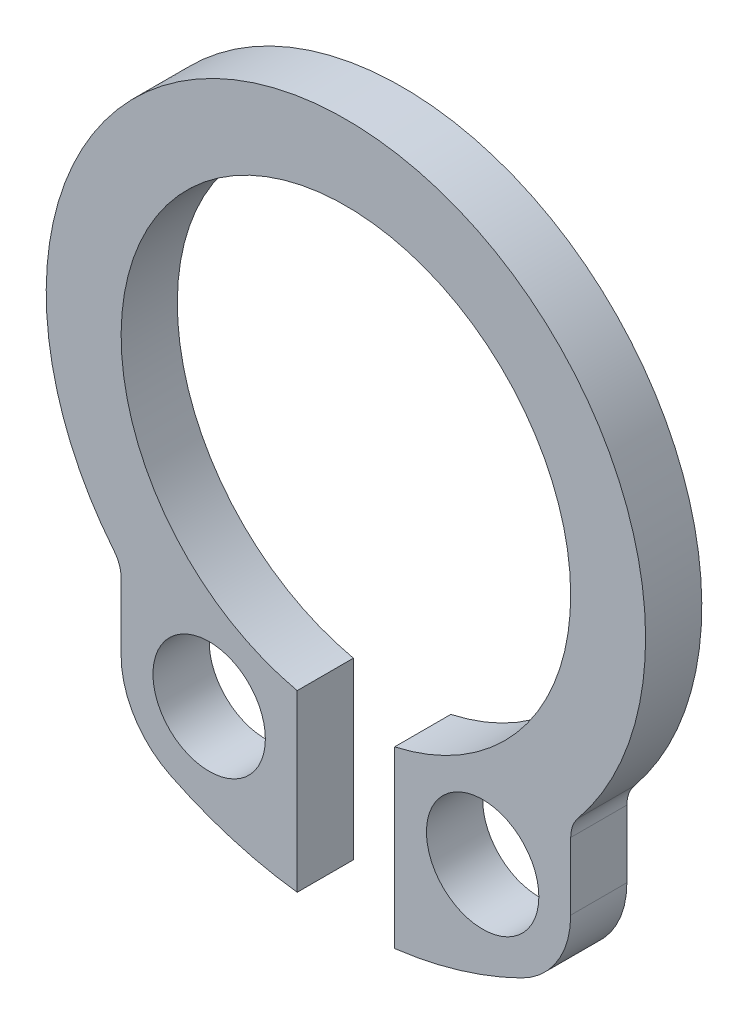
ISO-10303-21;
HEADER;
FILE_DESCRIPTION(('STEP AP214'),'2;1');
FILE_NAME('part.step','',(''),(''),'','','');
FILE_SCHEMA(('AUTOMOTIVE_DESIGN { 1 0 10303 214 1 1 1 1 }'));
ENDSEC;
DATA;
#1=APPLICATION_CONTEXT('core data for automotive mechanical design processes');
#2=APPLICATION_PROTOCOL_DEFINITION('international standard','automotive_design',2000,#1);
#3=PRODUCT_CONTEXT('',#1,'mechanical');
#4=PRODUCT('Part','Part','',(#3));
#5=PRODUCT_RELATED_PRODUCT_CATEGORY('part','',(#4));
#6=PRODUCT_DEFINITION_FORMATION('','',#4);
#7=PRODUCT_DEFINITION_CONTEXT('part definition',#1,'design');
#8=PRODUCT_DEFINITION('design','',#6,#7);
#9=PRODUCT_DEFINITION_SHAPE('','',#8);
#10=(LENGTH_UNIT() NAMED_UNIT(*) SI_UNIT(.MILLI.,.METRE.));
#11=(NAMED_UNIT(*) PLANE_ANGLE_UNIT() SI_UNIT($,.RADIAN.));
#12=(NAMED_UNIT(*) SI_UNIT($,.STERADIAN.) SOLID_ANGLE_UNIT());
#13=UNCERTAINTY_MEASURE_WITH_UNIT(LENGTH_MEASURE(1.E-05),#10,'distance_accuracy_value','');
#14=(GEOMETRIC_REPRESENTATION_CONTEXT(3) GLOBAL_UNCERTAINTY_ASSIGNED_CONTEXT((#13)) GLOBAL_UNIT_ASSIGNED_CONTEXT((#10,
#11,#12)) REPRESENTATION_CONTEXT('',''));
#15=CARTESIAN_POINT('',(0.,0.,0.));
#16=DIRECTION('',(0.,0.,1.));
#17=DIRECTION('',(1.,0.,0.));
#18=AXIS2_PLACEMENT_3D('',#15,#16,#17);
#19=CARTESIAN_POINT('',(0.252219626168226,3.65673068553637,0.75));
#20=DIRECTION('',(0.,0.,1.));
#21=DIRECTION('',(1.,0.,0.));
#22=AXIS2_PLACEMENT_3D('',#19,#20,#21);
#23=PLANE('',#22);
#24=CARTESIAN_POINT('',(-1.57278037383177,-0.042593577082424,0.75));
#25=DIRECTION('',(0.,0.,1.));
#26=DIRECTION('',(1.,0.,0.));
#27=AXIS2_PLACEMENT_3D('',#24,#25,#26);
#28=CIRCLE('',#27,0.749999999999996);
#29=CARTESIAN_POINT('',(-0.822780373831778,-0.042593577082424,0.75));
#30=VERTEX_POINT('',#29);
#31=EDGE_CURVE('E141',#30,#30,#28,.T.);
#32=ORIENTED_EDGE('',*,*,#31,.F.);
#33=EDGE_LOOP('',(#32));
#34=FACE_BOUND('',#33,.T.);
#35=CARTESIAN_POINT('',(0.252219626168226,3.65673068553637,0.75));
#36=DIRECTION('',(0.,0.,1.));
#37=DIRECTION('',(1.,0.,0.));
#38=AXIS2_PLACEMENT_3D('',#35,#36,#37);
#39=CIRCLE('',#38,5.30000000000369);
#40=CARTESIAN_POINT('',(-2.09262885868244,-1.09634048825704,0.75));
#41=VERTEX_POINT('',#40);
#42=CARTESIAN_POINT('',(-0.397780373831771,-1.60325980875409,0.75));
#43=VERTEX_POINT('',#42);
#44=EDGE_CURVE('E170',#41,#43,#39,.T.);
#45=ORIENTED_EDGE('',*,*,#44,.T.);
#46=DIRECTION('',(0.,1.,0.));
#47=VECTOR('',#46,1.);
#48=CARTESIAN_POINT('',(-0.397780373831771,-1.60325980875409,0.75));
#49=LINE('',#48,#47);
#50=CARTESIAN_POINT('',(-0.397780373831771,0.727993756414795,0.75));
#51=VERTEX_POINT('',#50);
#52=EDGE_CURVE('E136',#43,#51,#49,.T.);
#53=ORIENTED_EDGE('',*,*,#52,.T.);
#54=CARTESIAN_POINT('',(0.252219626168226,3.65673068553637,0.75));
#55=DIRECTION('',(0.,0.,1.));
#56=DIRECTION('',(1.,0.,0.));
#57=AXIS2_PLACEMENT_3D('',#54,#55,#56);
#58=CIRCLE('',#57,3.00000000000011);
#59=CARTESIAN_POINT('',(0.902219626168216,0.727993756414755,0.75));
#60=VERTEX_POINT('',#59);
#61=EDGE_CURVE('E173',#60,#51,#58,.T.);
#62=ORIENTED_EDGE('',*,*,#61,.F.);
#63=DIRECTION('',(0.,1.,0.));
#64=VECTOR('',#63,1.);
#65=CARTESIAN_POINT('',(0.902219626168224,-1.60325980875656,0.75));
#66=LINE('',#65,#64);
#67=CARTESIAN_POINT('',(0.902219626168224,-1.60325980875656,0.75));
#68=VERTEX_POINT('',#67);
#69=EDGE_CURVE('E176',#68,#60,#66,.T.);
#70=ORIENTED_EDGE('',*,*,#69,.F.);
#71=CARTESIAN_POINT('',(0.252219626168226,3.65673068553637,0.75));
#72=DIRECTION('',(0.,0.,1.));
#73=DIRECTION('',(1.,0.,0.));
#74=AXIS2_PLACEMENT_3D('',#71,#72,#73);
#75=CIRCLE('',#74,5.30000000000492);
#76=CARTESIAN_POINT('',(2.59706811101889,-1.09634048825702,0.75));
#77=VERTEX_POINT('',#76);
#78=EDGE_CURVE('E179',#68,#77,#75,.T.);
#79=ORIENTED_EDGE('',*,*,#78,.T.);
#80=CARTESIAN_POINT('',(2.07721962616823,-0.042593577082424,0.75));
#81=DIRECTION('',(0.,0.,1.));
#82=DIRECTION('',(1.,0.,0.));
#83=AXIS2_PLACEMENT_3D('',#80,#81,#82);
#84=CIRCLE('',#83,1.17500000000493);
#85=CARTESIAN_POINT('',(3.25221962617316,-0.0425935770824313,0.75));
#86=VERTEX_POINT('',#85);
#87=EDGE_CURVE('E181',#77,#86,#84,.T.);
#88=ORIENTED_EDGE('',*,*,#87,.T.);
#89=DIRECTION('',(-4.68335180346586E-12,1.,0.));
#90=VECTOR('',#89,1.);
#91=CARTESIAN_POINT('',(3.25221962617316,-0.0425935770824309,0.75));
#92=LINE('',#91,#90);
#93=CARTESIAN_POINT('',(3.25221962616896,0.855261182121425,0.75));
#94=VERTEX_POINT('',#93);
#95=EDGE_CURVE('E183',#86,#94,#92,.T.);
#96=ORIENTED_EDGE('',*,*,#95,.T.);
#97=CARTESIAN_POINT('',(3.67721962616895,0.855261182121425,0.75));
#98=DIRECTION('',(0.,0.,-1.));
#99=DIRECTION('',(-1.,0.,0.));
#100=AXIS2_PLACEMENT_3D('',#97,#98,#99);
#101=CIRCLE('',#100,0.424999999999997);
#102=CARTESIAN_POINT('',(3.34824996646882,1.12434102714289,0.75));
#103=VERTEX_POINT('',#102);
#104=EDGE_CURVE('E185',#94,#103,#101,.T.);
#105=ORIENTED_EDGE('',*,*,#104,.T.);
#106=CARTESIAN_POINT('',(0.252219626168226,3.65673068553637,0.75));
#107=DIRECTION('',(0.,0.,1.));
#108=DIRECTION('',(1.,0.,0.));
#109=AXIS2_PLACEMENT_3D('',#106,#107,#108);
#110=CIRCLE('',#109,3.99980015125756);
#111=CARTESIAN_POINT('',(-2.84381071413237,1.12434102714289,0.75));
#112=VERTEX_POINT('',#111);
#113=EDGE_CURVE('E187',#103,#112,#110,.T.);
#114=ORIENTED_EDGE('',*,*,#113,.T.);
#115=CARTESIAN_POINT('',(-3.1727803738325,0.855261182121425,0.75));
#116=DIRECTION('',(0.,0.,1.));
#117=DIRECTION('',(1.,0.,0.));
#118=AXIS2_PLACEMENT_3D('',#115,#116,#117);
#119=CIRCLE('',#118,0.424999999999997);
#120=CARTESIAN_POINT('',(-2.7477803738325,0.855261182119434,0.75));
#121=VERTEX_POINT('',#120);
#122=EDGE_CURVE('E189',#121,#112,#119,.T.);
#123=ORIENTED_EDGE('',*,*,#122,.F.);
#124=DIRECTION('',(4.67562350017018E-12,1.,0.));
#125=VECTOR('',#124,1.);
#126=CARTESIAN_POINT('',(-2.7477803738367,-0.0425935770824309,0.75));
#127=LINE('',#126,#125);
#128=CARTESIAN_POINT('',(-2.7477803738367,-0.0425935770824309,0.75));
#129=VERTEX_POINT('',#128);
#130=EDGE_CURVE('E192',#129,#121,#127,.T.);
#131=ORIENTED_EDGE('',*,*,#130,.F.);
#132=CARTESIAN_POINT('',(-1.57278037383177,-0.042593577082424,0.75));
#133=DIRECTION('',(0.,0.,1.));
#134=DIRECTION('',(1.,0.,0.));
#135=AXIS2_PLACEMENT_3D('',#132,#133,#134);
#136=CIRCLE('',#135,1.17500000000493);
#137=EDGE_CURVE('E45',#129,#41,#136,.T.);
#138=ORIENTED_EDGE('',*,*,#137,.T.);
#139=EDGE_LOOP('',(#45,#53,#62,#70,#79,#88,#96,#105,#114,#123,#131,#138));
#140=FACE_BOUND('',#139,.T.);
#141=CARTESIAN_POINT('',(2.07721962616823,-0.042593577082424,0.75));
#142=DIRECTION('',(0.,0.,1.));
#143=DIRECTION('',(1.,0.,0.));
#144=AXIS2_PLACEMENT_3D('',#141,#142,#143);
#145=CIRCLE('',#144,0.750000000000001);
#146=CARTESIAN_POINT('',(2.82721962616823,-0.042593577082424,0.75));
#147=VERTEX_POINT('',#146);
#148=EDGE_CURVE('E284',#147,#147,#145,.T.);
#149=ORIENTED_EDGE('',*,*,#148,.F.);
#150=EDGE_LOOP('',(#149));
#151=FACE_BOUND('',#150,.T.);
#152=ADVANCED_FACE('F30',(#34,#140,#151),#23,.T.);
#153=CARTESIAN_POINT('',(0.252219626168226,3.65673068553637,0.));
#154=DIRECTION('',(0.,0.,1.));
#155=DIRECTION('',(1.,0.,0.));
#156=AXIS2_PLACEMENT_3D('',#153,#154,#155);
#157=PLANE('',#156);
#158=CARTESIAN_POINT('',(-1.57278037383177,-0.042593577082424,0.));
#159=DIRECTION('',(0.,0.,1.));
#160=DIRECTION('',(1.,0.,0.));
#161=AXIS2_PLACEMENT_3D('',#158,#159,#160);
#162=CIRCLE('',#161,0.749999999999996);
#163=CARTESIAN_POINT('',(-0.822780373831778,-0.042593577082424,0.));
#164=VERTEX_POINT('',#163);
#165=EDGE_CURVE('E144',#164,#164,#162,.T.);
#166=ORIENTED_EDGE('',*,*,#165,.T.);
#167=EDGE_LOOP('',(#166));
#168=FACE_BOUND('',#167,.T.);
#169=CARTESIAN_POINT('',(0.252219626168226,3.65673068553637,0.));
#170=DIRECTION('',(0.,0.,1.));
#171=DIRECTION('',(1.,0.,0.));
#172=AXIS2_PLACEMENT_3D('',#169,#170,#171);
#173=CIRCLE('',#172,5.30000000000369);
#174=CARTESIAN_POINT('',(-2.09262885868244,-1.09634048825704,0.));
#175=VERTEX_POINT('',#174);
#176=CARTESIAN_POINT('',(-0.397780373831771,-1.60325980875409,0.));
#177=VERTEX_POINT('',#176);
#178=EDGE_CURVE('E127',#175,#177,#173,.T.);
#179=ORIENTED_EDGE('',*,*,#178,.F.);
#180=CARTESIAN_POINT('',(-1.57278037383177,-0.042593577082424,0.));
#181=DIRECTION('',(0.,0.,1.));
#182=DIRECTION('',(1.,0.,0.));
#183=AXIS2_PLACEMENT_3D('',#180,#181,#182);
#184=CIRCLE('',#183,1.17500000000493);
#185=CARTESIAN_POINT('',(-2.7477803738367,-0.0425935770824309,0.));
#186=VERTEX_POINT('',#185);
#187=EDGE_CURVE('E168',#186,#175,#184,.T.);
#188=ORIENTED_EDGE('',*,*,#187,.F.);
#189=DIRECTION('',(4.67562350017018E-12,1.,0.));
#190=VECTOR('',#189,1.);
#191=CARTESIAN_POINT('',(-2.7477803738367,-0.0425935770824309,0.));
#192=LINE('',#191,#190);
#193=CARTESIAN_POINT('',(-2.7477803738325,0.855261182119434,0.));
#194=VERTEX_POINT('',#193);
#195=EDGE_CURVE('E165',#186,#194,#192,.T.);
#196=ORIENTED_EDGE('',*,*,#195,.T.);
#197=CARTESIAN_POINT('',(-3.1727803738325,0.855261182121425,0.));
#198=DIRECTION('',(0.,0.,1.));
#199=DIRECTION('',(1.,0.,0.));
#200=AXIS2_PLACEMENT_3D('',#197,#198,#199);
#201=CIRCLE('',#200,0.424999999999997);
#202=CARTESIAN_POINT('',(-2.84381071413237,1.12434102714289,0.));
#203=VERTEX_POINT('',#202);
#204=EDGE_CURVE('E162',#194,#203,#201,.T.);
#205=ORIENTED_EDGE('',*,*,#204,.T.);
#206=CARTESIAN_POINT('',(0.252219626168226,3.65673068553637,0.));
#207=DIRECTION('',(0.,0.,1.));
#208=DIRECTION('',(1.,0.,0.));
#209=AXIS2_PLACEMENT_3D('',#206,#207,#208);
#210=CIRCLE('',#209,3.99980015125756);
#211=CARTESIAN_POINT('',(3.34824996646882,1.12434102714289,0.));
#212=VERTEX_POINT('',#211);
#213=EDGE_CURVE('E159',#212,#203,#210,.T.);
#214=ORIENTED_EDGE('',*,*,#213,.F.);
#215=CARTESIAN_POINT('',(3.67721962616895,0.855261182121425,0.));
#216=DIRECTION('',(0.,0.,-1.));
#217=DIRECTION('',(-1.,0.,0.));
#218=AXIS2_PLACEMENT_3D('',#215,#216,#217);
#219=CIRCLE('',#218,0.424999999999997);
#220=CARTESIAN_POINT('',(3.25221962616896,0.855261182121425,0.));
#221=VERTEX_POINT('',#220);
#222=EDGE_CURVE('E157',#221,#212,#219,.T.);
#223=ORIENTED_EDGE('',*,*,#222,.F.);
#224=DIRECTION('',(-4.68335180346586E-12,1.,0.));
#225=VECTOR('',#224,1.);
#226=CARTESIAN_POINT('',(3.25221962617316,-0.0425935770824309,0.));
#227=LINE('',#226,#225);
#228=CARTESIAN_POINT('',(3.25221962617316,-0.0425935770824313,0.));
#229=VERTEX_POINT('',#228);
#230=EDGE_CURVE('E155',#229,#221,#227,.T.);
#231=ORIENTED_EDGE('',*,*,#230,.F.);
#232=CARTESIAN_POINT('',(2.07721962616823,-0.042593577082424,0.));
#233=DIRECTION('',(0.,0.,1.));
#234=DIRECTION('',(1.,0.,0.));
#235=AXIS2_PLACEMENT_3D('',#232,#233,#234);
#236=CIRCLE('',#235,1.17500000000493);
#237=CARTESIAN_POINT('',(2.59706811101889,-1.09634048825702,0.));
#238=VERTEX_POINT('',#237);
#239=EDGE_CURVE('E153',#238,#229,#236,.T.);
#240=ORIENTED_EDGE('',*,*,#239,.F.);
#241=CARTESIAN_POINT('',(0.252219626168226,3.65673068553637,0.));
#242=DIRECTION('',(0.,0.,1.));
#243=DIRECTION('',(1.,0.,0.));
#244=AXIS2_PLACEMENT_3D('',#241,#242,#243);
#245=CIRCLE('',#244,5.30000000000492);
#246=CARTESIAN_POINT('',(0.902219626168224,-1.60325980875656,0.));
#247=VERTEX_POINT('',#246);
#248=EDGE_CURVE('E151',#247,#238,#245,.T.);
#249=ORIENTED_EDGE('',*,*,#248,.F.);
#250=DIRECTION('',(0.,1.,0.));
#251=VECTOR('',#250,1.);
#252=CARTESIAN_POINT('',(0.902219626168224,-1.60325980875656,0.));
#253=LINE('',#252,#251);
#254=CARTESIAN_POINT('',(0.902219626168216,0.727993756414755,0.));
#255=VERTEX_POINT('',#254);
#256=EDGE_CURVE('E149',#247,#255,#253,.T.);
#257=ORIENTED_EDGE('',*,*,#256,.T.);
#258=CARTESIAN_POINT('',(0.252219626168226,3.65673068553637,0.));
#259=DIRECTION('',(0.,0.,1.));
#260=DIRECTION('',(1.,0.,0.));
#261=AXIS2_PLACEMENT_3D('',#258,#259,#260);
#262=CIRCLE('',#261,3.00000000000011);
#263=CARTESIAN_POINT('',(-0.397780373831771,0.727993756414795,0.));
#264=VERTEX_POINT('',#263);
#265=EDGE_CURVE('E130',#255,#264,#262,.T.);
#266=ORIENTED_EDGE('',*,*,#265,.T.);
#267=DIRECTION('',(0.,1.,0.));
#268=VECTOR('',#267,1.);
#269=CARTESIAN_POINT('',(-0.397780373831771,-1.60325980875409,0.));
#270=LINE('',#269,#268);
#271=EDGE_CURVE('E122',#177,#264,#270,.T.);
#272=ORIENTED_EDGE('',*,*,#271,.F.);
#273=EDGE_LOOP('',(#179,#188,#196,#205,#214,#223,#231,#240,#249,#257,#266,#272));
#274=FACE_BOUND('',#273,.T.);
#275=CARTESIAN_POINT('',(2.07721962616823,-0.042593577082424,0.));
#276=DIRECTION('',(0.,0.,1.));
#277=DIRECTION('',(1.,0.,0.));
#278=AXIS2_PLACEMENT_3D('',#275,#276,#277);
#279=CIRCLE('',#278,0.750000000000001);
#280=CARTESIAN_POINT('',(2.82721962616823,-0.042593577082424,0.));
#281=VERTEX_POINT('',#280);
#282=EDGE_CURVE('E287',#281,#281,#279,.T.);
#283=ORIENTED_EDGE('',*,*,#282,.T.);
#284=EDGE_LOOP('',(#283));
#285=FACE_BOUND('',#284,.T.);
#286=ADVANCED_FACE('F123',(#168,#274,#285),#157,.F.);
#287=CARTESIAN_POINT('',(0.252219626168226,3.65673068553637,0.75));
#288=DIRECTION('',(0.,0.,-1.));
#289=DIRECTION('',(-1.,0.,0.));
#290=AXIS2_PLACEMENT_3D('',#287,#288,#289);
#291=CYLINDRICAL_SURFACE('',#290,5.30000000000369);
#292=ORIENTED_EDGE('',*,*,#178,.T.);
#293=DIRECTION('',(0.,0.,-1.));
#294=VECTOR('',#293,1.);
#295=CARTESIAN_POINT('',(-0.397780373831771,-1.60325980875409,0.75));
#296=LINE('',#295,#294);
#297=EDGE_CURVE('E11',#43,#177,#296,.T.);
#298=ORIENTED_EDGE('',*,*,#297,.F.);
#299=ORIENTED_EDGE('',*,*,#44,.F.);
#300=DIRECTION('',(0.,0.,-1.));
#301=VECTOR('',#300,1.);
#302=CARTESIAN_POINT('',(-2.09262885868244,-1.09634048825704,0.75));
#303=LINE('',#302,#301);
#304=EDGE_CURVE('E140',#41,#175,#303,.T.);
#305=ORIENTED_EDGE('',*,*,#304,.T.);
#306=EDGE_LOOP('',(#292,#298,#299,#305));
#307=FACE_BOUND('',#306,.T.);
#308=ADVANCED_FACE('F32',(#307),#291,.T.);
#309=CARTESIAN_POINT('',(-0.397780373831771,-1.60325980875409,0.75));
#310=DIRECTION('',(-1.,0.,0.));
#311=DIRECTION('',(0.,0.,1.));
#312=AXIS2_PLACEMENT_3D('',#309,#310,#311);
#313=PLANE('',#312);
#314=ORIENTED_EDGE('',*,*,#271,.T.);
#315=DIRECTION('',(0.,0.,-1.));
#316=VECTOR('',#315,1.);
#317=CARTESIAN_POINT('',(-0.397780373831771,0.727993756414795,0.75));
#318=LINE('',#317,#316);
#319=EDGE_CURVE('E38',#51,#264,#318,.T.);
#320=ORIENTED_EDGE('',*,*,#319,.F.);
#321=ORIENTED_EDGE('',*,*,#52,.F.);
#322=ORIENTED_EDGE('',*,*,#297,.T.);
#323=EDGE_LOOP('',(#314,#320,#321,#322));
#324=FACE_BOUND('',#323,.T.);
#325=ADVANCED_FACE('F135',(#324),#313,.F.);
#326=CARTESIAN_POINT('',(0.252219626168226,3.65673068553637,0.75));
#327=DIRECTION('',(0.,0.,-1.));
#328=DIRECTION('',(-1.,0.,0.));
#329=AXIS2_PLACEMENT_3D('',#326,#327,#328);
#330=CYLINDRICAL_SURFACE('',#329,3.00000000000011);
#331=ORIENTED_EDGE('',*,*,#265,.F.);
#332=DIRECTION('',(0.,0.,-1.));
#333=VECTOR('',#332,1.);
#334=CARTESIAN_POINT('',(0.902219626168216,0.727993756414755,0.75));
#335=LINE('',#334,#333);
#336=EDGE_CURVE('E215',#60,#255,#335,.T.);
#337=ORIENTED_EDGE('',*,*,#336,.F.);
#338=ORIENTED_EDGE('',*,*,#61,.T.);
#339=ORIENTED_EDGE('',*,*,#319,.T.);
#340=EDGE_LOOP('',(#331,#337,#338,#339));
#341=FACE_BOUND('',#340,.T.);
#342=ADVANCED_FACE('F217',(#341),#330,.F.);
#343=CARTESIAN_POINT('',(0.902219626168224,-1.60325980875656,0.75));
#344=DIRECTION('',(-1.,0.,0.));
#345=DIRECTION('',(0.,0.,1.));
#346=AXIS2_PLACEMENT_3D('',#343,#344,#345);
#347=PLANE('',#346);
#348=ORIENTED_EDGE('',*,*,#256,.F.);
#349=DIRECTION('',(0.,0.,-1.));
#350=VECTOR('',#349,1.);
#351=CARTESIAN_POINT('',(0.902219626168224,-1.60325980875656,0.75));
#352=LINE('',#351,#350);
#353=EDGE_CURVE('E213',#68,#247,#352,.T.);
#354=ORIENTED_EDGE('',*,*,#353,.F.);
#355=ORIENTED_EDGE('',*,*,#69,.T.);
#356=ORIENTED_EDGE('',*,*,#336,.T.);
#357=EDGE_LOOP('',(#348,#354,#355,#356));
#358=FACE_BOUND('',#357,.T.);
#359=ADVANCED_FACE('F223',(#358),#347,.T.);
#360=CARTESIAN_POINT('',(0.252219626168226,3.65673068553637,0.75));
#361=DIRECTION('',(0.,0.,-1.));
#362=DIRECTION('',(-1.,0.,0.));
#363=AXIS2_PLACEMENT_3D('',#360,#361,#362);
#364=CYLINDRICAL_SURFACE('',#363,5.30000000000492);
#365=ORIENTED_EDGE('',*,*,#248,.T.);
#366=DIRECTION('',(0.,0.,-1.));
#367=VECTOR('',#366,1.);
#368=CARTESIAN_POINT('',(2.59706811101889,-1.09634048825702,0.75));
#369=LINE('',#368,#367);
#370=EDGE_CURVE('E210',#77,#238,#369,.T.);
#371=ORIENTED_EDGE('',*,*,#370,.F.);
#372=ORIENTED_EDGE('',*,*,#78,.F.);
#373=ORIENTED_EDGE('',*,*,#353,.T.);
#374=EDGE_LOOP('',(#365,#371,#372,#373));
#375=FACE_BOUND('',#374,.T.);
#376=ADVANCED_FACE('F228',(#375),#364,.T.);
#377=CARTESIAN_POINT('',(2.07721962616823,-0.042593577082424,0.75));
#378=DIRECTION('',(0.,0.,-1.));
#379=DIRECTION('',(-1.,0.,0.));
#380=AXIS2_PLACEMENT_3D('',#377,#378,#379);
#381=CYLINDRICAL_SURFACE('',#380,1.17500000000493);
#382=ORIENTED_EDGE('',*,*,#239,.T.);
#383=DIRECTION('',(0.,0.,-1.));
#384=VECTOR('',#383,1.);
#385=CARTESIAN_POINT('',(3.25221962617316,-0.0425935770824313,0.75));
#386=LINE('',#385,#384);
#387=EDGE_CURVE('E207',#86,#229,#386,.T.);
#388=ORIENTED_EDGE('',*,*,#387,.F.);
#389=ORIENTED_EDGE('',*,*,#87,.F.);
#390=ORIENTED_EDGE('',*,*,#370,.T.);
#391=EDGE_LOOP('',(#382,#388,#389,#390));
#392=FACE_BOUND('',#391,.T.);
#393=ADVANCED_FACE('F234',(#392),#381,.T.);
#394=CARTESIAN_POINT('',(3.25221962617316,-0.0425935770824309,0.75));
#395=DIRECTION('',(-1.,-4.68335180346586E-12,0.));
#396=DIRECTION('',(4.68335180346586E-12,-1.,0.));
#397=AXIS2_PLACEMENT_3D('',#394,#395,#396);
#398=PLANE('',#397);
#399=ORIENTED_EDGE('',*,*,#230,.T.);
#400=DIRECTION('',(0.,0.,-1.));
#401=VECTOR('',#400,1.);
#402=CARTESIAN_POINT('',(3.25221962616896,0.855261182121425,0.75));
#403=LINE('',#402,#401);
#404=EDGE_CURVE('E204',#94,#221,#403,.T.);
#405=ORIENTED_EDGE('',*,*,#404,.F.);
#406=ORIENTED_EDGE('',*,*,#95,.F.);
#407=ORIENTED_EDGE('',*,*,#387,.T.);
#408=EDGE_LOOP('',(#399,#405,#406,#407));
#409=FACE_BOUND('',#408,.T.);
#410=ADVANCED_FACE('F238',(#409),#398,.F.);
#411=CARTESIAN_POINT('',(3.67721962616895,0.855261182121425,0.75));
#412=DIRECTION('',(0.,0.,-1.));
#413=DIRECTION('',(-1.,0.,0.));
#414=AXIS2_PLACEMENT_3D('',#411,#412,#413);
#415=CYLINDRICAL_SURFACE('',#414,0.424999999999997);
#416=ORIENTED_EDGE('',*,*,#222,.T.);
#417=DIRECTION('',(0.,0.,-1.));
#418=VECTOR('',#417,1.);
#419=CARTESIAN_POINT('',(3.34824996646882,1.12434102714289,0.75));
#420=LINE('',#419,#418);
#421=EDGE_CURVE('E201',#103,#212,#420,.T.);
#422=ORIENTED_EDGE('',*,*,#421,.F.);
#423=ORIENTED_EDGE('',*,*,#104,.F.);
#424=ORIENTED_EDGE('',*,*,#404,.T.);
#425=EDGE_LOOP('',(#416,#422,#423,#424));
#426=FACE_BOUND('',#425,.T.);
#427=ADVANCED_FACE('F243',(#426),#415,.F.);
#428=CARTESIAN_POINT('',(0.252219626168226,3.65673068553637,0.75));
#429=DIRECTION('',(0.,0.,-1.));
#430=DIRECTION('',(-1.,0.,0.));
#431=AXIS2_PLACEMENT_3D('',#428,#429,#430);
#432=CYLINDRICAL_SURFACE('',#431,3.99980015125756);
#433=ORIENTED_EDGE('',*,*,#213,.T.);
#434=DIRECTION('',(0.,0.,-1.));
#435=VECTOR('',#434,1.);
#436=CARTESIAN_POINT('',(-2.84381071413237,1.12434102714289,0.75));
#437=LINE('',#436,#435);
#438=EDGE_CURVE('E199',#112,#203,#437,.T.);
#439=ORIENTED_EDGE('',*,*,#438,.F.);
#440=ORIENTED_EDGE('',*,*,#113,.F.);
#441=ORIENTED_EDGE('',*,*,#421,.T.);
#442=EDGE_LOOP('',(#433,#439,#440,#441));
#443=FACE_BOUND('',#442,.T.);
#444=ADVANCED_FACE('F248',(#443),#432,.T.);
#445=CARTESIAN_POINT('',(-3.1727803738325,0.855261182121425,0.75));
#446=DIRECTION('',(0.,0.,-1.));
#447=DIRECTION('',(-1.,0.,0.));
#448=AXIS2_PLACEMENT_3D('',#445,#446,#447);
#449=CYLINDRICAL_SURFACE('',#448,0.424999999999997);
#450=ORIENTED_EDGE('',*,*,#204,.F.);
#451=DIRECTION('',(0.,0.,-1.));
#452=VECTOR('',#451,1.);
#453=CARTESIAN_POINT('',(-2.7477803738325,0.855261182119434,0.75));
#454=LINE('',#453,#452);
#455=EDGE_CURVE('E197',#121,#194,#454,.T.);
#456=ORIENTED_EDGE('',*,*,#455,.F.);
#457=ORIENTED_EDGE('',*,*,#122,.T.);
#458=ORIENTED_EDGE('',*,*,#438,.T.);
#459=EDGE_LOOP('',(#450,#456,#457,#458));
#460=FACE_BOUND('',#459,.T.);
#461=ADVANCED_FACE('F252',(#460),#449,.F.);
#462=CARTESIAN_POINT('',(-2.7477803738367,-0.0425935770824309,0.75));
#463=DIRECTION('',(-1.,4.67562350017018E-12,0.));
#464=DIRECTION('',(-4.67562350017018E-12,-1.,0.));
#465=AXIS2_PLACEMENT_3D('',#462,#463,#464);
#466=PLANE('',#465);
#467=ORIENTED_EDGE('',*,*,#195,.F.);
#468=DIRECTION('',(0.,0.,-1.));
#469=VECTOR('',#468,1.);
#470=CARTESIAN_POINT('',(-2.7477803738367,-0.0425935770824309,0.75));
#471=LINE('',#470,#469);
#472=EDGE_CURVE('E53',#129,#186,#471,.T.);
#473=ORIENTED_EDGE('',*,*,#472,.F.);
#474=ORIENTED_EDGE('',*,*,#130,.T.);
#475=ORIENTED_EDGE('',*,*,#455,.T.);
#476=EDGE_LOOP('',(#467,#473,#474,#475));
#477=FACE_BOUND('',#476,.T.);
#478=ADVANCED_FACE('F253',(#477),#466,.T.);
#479=CARTESIAN_POINT('',(-1.57278037383177,-0.042593577082424,0.75));
#480=DIRECTION('',(0.,0.,-1.));
#481=DIRECTION('',(-1.,0.,0.));
#482=AXIS2_PLACEMENT_3D('',#479,#480,#481);
#483=CYLINDRICAL_SURFACE('',#482,1.17500000000493);
#484=ORIENTED_EDGE('',*,*,#187,.T.);
#485=ORIENTED_EDGE('',*,*,#304,.F.);
#486=ORIENTED_EDGE('',*,*,#137,.F.);
#487=ORIENTED_EDGE('',*,*,#472,.T.);
#488=EDGE_LOOP('',(#484,#485,#486,#487));
#489=FACE_BOUND('',#488,.T.);
#490=ADVANCED_FACE('F255',(#489),#483,.T.);
#491=CARTESIAN_POINT('',(-1.57278037383177,-0.042593577082424,0.75));
#492=DIRECTION('',(0.,0.,-1.));
#493=DIRECTION('',(-1.,0.,0.));
#494=AXIS2_PLACEMENT_3D('',#491,#492,#493);
#495=CYLINDRICAL_SURFACE('',#494,0.749999999999996);
#496=ORIENTED_EDGE('',*,*,#31,.T.);
#497=EDGE_LOOP('',(#496));
#498=FACE_BOUND('',#497,.T.);
#499=ORIENTED_EDGE('',*,*,#165,.F.);
#500=EDGE_LOOP('',(#499));
#501=FACE_BOUND('',#500,.T.);
#502=ADVANCED_FACE('F257',(#498,#501),#495,.F.);
#503=CARTESIAN_POINT('',(2.07721962616823,-0.042593577082424,0.75));
#504=DIRECTION('',(0.,0.,-1.));
#505=DIRECTION('',(-1.,0.,0.));
#506=AXIS2_PLACEMENT_3D('',#503,#504,#505);
#507=CYLINDRICAL_SURFACE('',#506,0.750000000000001);
#508=ORIENTED_EDGE('',*,*,#148,.T.);
#509=EDGE_LOOP('',(#508));
#510=FACE_BOUND('',#509,.T.);
#511=ORIENTED_EDGE('',*,*,#282,.F.);
#512=EDGE_LOOP('',(#511));
#513=FACE_BOUND('',#512,.T.);
#514=ADVANCED_FACE('F263',(#510,#513),#507,.F.);
#515=CLOSED_SHELL('',(#152,#286,#308,#325,#342,#359,#376,#393,#410,#427,#444,#461,#478,#490,
#502,#514));
#516=MANIFOLD_SOLID_BREP('B2',#515);
#517=ADVANCED_BREP_SHAPE_REPRESENTATION('',(#18,#516),#14);
#518=SHAPE_DEFINITION_REPRESENTATION(#9,#517);
ENDSEC;
END-ISO-10303-21;
